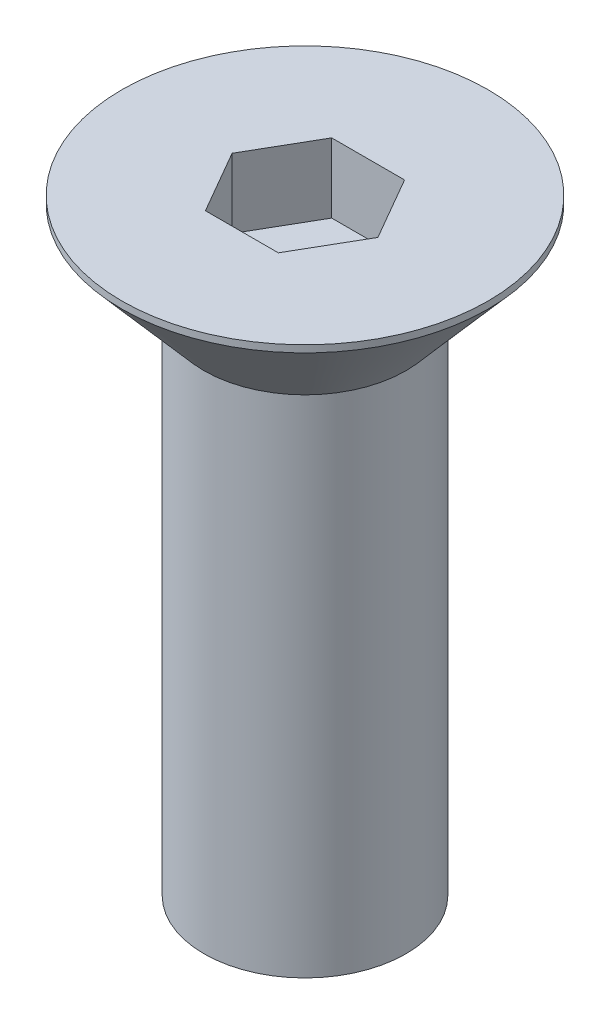
ISO-10303-21;
HEADER;
FILE_DESCRIPTION(('STEP AP214'),'2;1');
FILE_NAME('part.step','',(''),(''),'','','');
FILE_SCHEMA(('AUTOMOTIVE_DESIGN { 1 0 10303 214 1 1 1 1 }'));
ENDSEC;
DATA;
#1=APPLICATION_CONTEXT('core data for automotive mechanical design processes');
#2=APPLICATION_PROTOCOL_DEFINITION('international standard','automotive_design',2000,#1);
#3=PRODUCT_CONTEXT('',#1,'mechanical');
#4=PRODUCT('Part','Part','',(#3));
#5=PRODUCT_RELATED_PRODUCT_CATEGORY('part','',(#4));
#6=PRODUCT_DEFINITION_FORMATION('','',#4);
#7=PRODUCT_DEFINITION_CONTEXT('part definition',#1,'design');
#8=PRODUCT_DEFINITION('design','',#6,#7);
#9=PRODUCT_DEFINITION_SHAPE('','',#8);
#10=(LENGTH_UNIT() NAMED_UNIT(*) SI_UNIT(.MILLI.,.METRE.));
#11=(NAMED_UNIT(*) PLANE_ANGLE_UNIT() SI_UNIT($,.RADIAN.));
#12=(NAMED_UNIT(*) SI_UNIT($,.STERADIAN.) SOLID_ANGLE_UNIT());
#13=UNCERTAINTY_MEASURE_WITH_UNIT(LENGTH_MEASURE(1.E-05),#10,'distance_accuracy_value','');
#14=(GEOMETRIC_REPRESENTATION_CONTEXT(3) GLOBAL_UNCERTAINTY_ASSIGNED_CONTEXT((#13)) GLOBAL_UNIT_ASSIGNED_CONTEXT((#10,
#11,#12)) REPRESENTATION_CONTEXT('',''));
#15=CARTESIAN_POINT('',(0.,0.,0.));
#16=DIRECTION('',(0.,0.,1.));
#17=DIRECTION('',(1.,0.,0.));
#18=AXIS2_PLACEMENT_3D('',#15,#16,#17);
#19=CARTESIAN_POINT('',(0.,0.,0.));
#20=DIRECTION('',(0.,1.,0.));
#21=DIRECTION('',(0.,0.,1.));
#22=AXIS2_PLACEMENT_3D('',#19,#20,#21);
#23=CONICAL_SURFACE('',#22,6.35,0.715584993317676);
#24=CARTESIAN_POINT('',(0.,5.93518200100589,0.));
#25=DIRECTION('',(0.,-1.,0.));
#26=DIRECTION('',(0.,0.,-1.));
#27=AXIS2_PLACEMENT_3D('',#24,#25,#26);
#28=CIRCLE('',#27,11.509375);
#29=CARTESIAN_POINT('',(0.,5.93518200100589,-11.509375));
#30=VERTEX_POINT('',#29);
#31=EDGE_CURVE('E11',#30,#30,#28,.T.);
#32=ORIENTED_EDGE('',*,*,#31,.T.);
#33=EDGE_LOOP('',(#32));
#34=FACE_BOUND('',#33,.T.);
#35=CARTESIAN_POINT('',(0.,0.,0.));
#36=DIRECTION('',(0.,-1.,0.));
#37=DIRECTION('',(0.,0.,-1.));
#38=AXIS2_PLACEMENT_3D('',#35,#36,#37);
#39=CIRCLE('',#38,6.35);
#40=CARTESIAN_POINT('',(0.,0.,-6.35));
#41=VERTEX_POINT('',#40);
#42=EDGE_CURVE('E141',#41,#41,#39,.T.);
#43=ORIENTED_EDGE('',*,*,#42,.F.);
#44=EDGE_LOOP('',(#43));
#45=FACE_BOUND('',#44,.T.);
#46=ADVANCED_FACE('F30',(#34,#45),#23,.T.);
#47=CARTESIAN_POINT('',(0.,-1.82358766950444,0.));
#48=DIRECTION('',(0.,-1.,0.));
#49=DIRECTION('',(0.,0.,-1.));
#50=AXIS2_PLACEMENT_3D('',#47,#48,#49);
#51=CYLINDRICAL_SURFACE('',#50,11.509375);
#52=CARTESIAN_POINT('',(0.,6.3754,0.));
#53=DIRECTION('',(0.,-1.,0.));
#54=DIRECTION('',(0.,0.,-1.));
#55=AXIS2_PLACEMENT_3D('',#52,#53,#54);
#56=CIRCLE('',#55,11.509375);
#57=CARTESIAN_POINT('',(0.,6.3754,-11.509375));
#58=VERTEX_POINT('',#57);
#59=EDGE_CURVE('E37',#58,#58,#56,.T.);
#60=ORIENTED_EDGE('',*,*,#59,.T.);
#61=EDGE_LOOP('',(#60));
#62=FACE_BOUND('',#61,.T.);
#63=ORIENTED_EDGE('',*,*,#31,.F.);
#64=EDGE_LOOP('',(#63));
#65=FACE_BOUND('',#64,.T.);
#66=ADVANCED_FACE('F146',(#62,#65),#51,.T.);
#67=CARTESIAN_POINT('',(0.,6.3754,0.));
#68=DIRECTION('',(0.,1.,0.));
#69=DIRECTION('',(0.,0.,1.));
#70=AXIS2_PLACEMENT_3D('',#67,#68,#69);
#71=PLANE('',#70);
#72=DIRECTION('',(0.5,0.,0.866025403784438));
#73=VECTOR('',#72,1.);
#74=CARTESIAN_POINT('',(-4.58271776169266,6.3754,0.));
#75=LINE('',#74,#73);
#76=CARTESIAN_POINT('',(-4.58271776169266,6.3754,0.));
#77=VERTEX_POINT('',#76);
#78=CARTESIAN_POINT('',(-2.29135888084633,6.3754,3.96875));
#79=VERTEX_POINT('',#78);
#80=EDGE_CURVE('E44',#77,#79,#75,.T.);
#81=ORIENTED_EDGE('',*,*,#80,.F.);
#82=DIRECTION('',(-0.5,0.,0.866025403784439));
#83=VECTOR('',#82,1.);
#84=CARTESIAN_POINT('',(-2.29135888084633,6.3754,-3.96875));
#85=LINE('',#84,#83);
#86=CARTESIAN_POINT('',(-2.29135888084633,6.3754,-3.96875));
#87=VERTEX_POINT('',#86);
#88=EDGE_CURVE('E114',#87,#77,#85,.T.);
#89=ORIENTED_EDGE('',*,*,#88,.F.);
#90=DIRECTION('',(-1.,0.,0.));
#91=VECTOR('',#90,1.);
#92=CARTESIAN_POINT('',(2.29135888084632,6.3754,-3.96875));
#93=LINE('',#92,#91);
#94=CARTESIAN_POINT('',(2.29135888084632,6.3754,-3.96875));
#95=VERTEX_POINT('',#94);
#96=EDGE_CURVE('E108',#95,#87,#93,.T.);
#97=ORIENTED_EDGE('',*,*,#96,.F.);
#98=DIRECTION('',(-0.500000000000001,0.,-0.866025403784438));
#99=VECTOR('',#98,1.);
#100=CARTESIAN_POINT('',(4.58271776169266,6.3754,0.));
#101=LINE('',#100,#99);
#102=CARTESIAN_POINT('',(4.58271776169266,6.3754,0.));
#103=VERTEX_POINT('',#102);
#104=EDGE_CURVE('E106',#103,#95,#101,.T.);
#105=ORIENTED_EDGE('',*,*,#104,.F.);
#106=DIRECTION('',(0.5,0.,-0.866025403784439));
#107=VECTOR('',#106,1.);
#108=CARTESIAN_POINT('',(2.29135888084633,6.3754,3.96875));
#109=LINE('',#108,#107);
#110=CARTESIAN_POINT('',(2.29135888084633,6.3754,3.96875));
#111=VERTEX_POINT('',#110);
#112=EDGE_CURVE('E87',#111,#103,#109,.T.);
#113=ORIENTED_EDGE('',*,*,#112,.F.);
#114=DIRECTION('',(1.,0.,0.));
#115=VECTOR('',#114,1.);
#116=CARTESIAN_POINT('',(-2.29135888084633,6.3754,3.96875));
#117=LINE('',#116,#115);
#118=EDGE_CURVE('E98',#79,#111,#117,.T.);
#119=ORIENTED_EDGE('',*,*,#118,.F.);
#120=EDGE_LOOP('',(#81,#89,#97,#105,#113,#119));
#121=FACE_BOUND('',#120,.T.);
#122=ORIENTED_EDGE('',*,*,#59,.F.);
#123=EDGE_LOOP('',(#122));
#124=FACE_BOUND('',#123,.T.);
#125=ADVANCED_FACE('F102',(#121,#124),#71,.T.);
#126=CARTESIAN_POINT('',(0.,-31.75,0.));
#127=DIRECTION('',(0.,1.,0.));
#128=DIRECTION('',(0.,0.,1.));
#129=AXIS2_PLACEMENT_3D('',#126,#127,#128);
#130=CYLINDRICAL_SURFACE('',#129,6.35);
#131=CARTESIAN_POINT('',(0.,-31.75,0.));
#132=DIRECTION('',(0.,1.,0.));
#133=DIRECTION('',(0.,0.,1.));
#134=AXIS2_PLACEMENT_3D('',#131,#132,#133);
#135=CIRCLE('',#134,6.35);
#136=CARTESIAN_POINT('',(0.,-31.75,6.35));
#137=VERTEX_POINT('',#136);
#138=EDGE_CURVE('E132',#137,#137,#135,.T.);
#139=ORIENTED_EDGE('',*,*,#138,.T.);
#140=EDGE_LOOP('',(#139));
#141=FACE_BOUND('',#140,.T.);
#142=ORIENTED_EDGE('',*,*,#42,.T.);
#143=EDGE_LOOP('',(#142));
#144=FACE_BOUND('',#143,.T.);
#145=ADVANCED_FACE('F149',(#141,#144),#130,.T.);
#146=CARTESIAN_POINT('',(0.,-31.75,0.));
#147=DIRECTION('',(0.,1.,0.));
#148=DIRECTION('',(0.,0.,1.));
#149=AXIS2_PLACEMENT_3D('',#146,#147,#148);
#150=PLANE('',#149);
#151=ORIENTED_EDGE('',*,*,#138,.F.);
#152=EDGE_LOOP('',(#151));
#153=FACE_BOUND('',#152,.T.);
#154=ADVANCED_FACE('F155',(#153),#150,.F.);
#155=CARTESIAN_POINT('',(-4.58271776169266,2.0066,0.));
#156=DIRECTION('',(-0.866025403784438,0.,0.5));
#157=DIRECTION('',(0.5,0.,0.866025403784439));
#158=AXIS2_PLACEMENT_3D('',#155,#156,#157);
#159=PLANE('',#158);
#160=ORIENTED_EDGE('',*,*,#80,.T.);
#161=DIRECTION('',(0.,1.,0.));
#162=VECTOR('',#161,1.);
#163=CARTESIAN_POINT('',(-2.29135888084633,2.0066,3.96875));
#164=LINE('',#163,#162);
#165=CARTESIAN_POINT('',(-2.29135888084633,2.0066,3.96875));
#166=VERTEX_POINT('',#165);
#167=EDGE_CURVE('E95',#166,#79,#164,.T.);
#168=ORIENTED_EDGE('',*,*,#167,.F.);
#169=DIRECTION('',(0.5,0.,0.866025403784438));
#170=VECTOR('',#169,1.);
#171=CARTESIAN_POINT('',(-4.58271776169266,2.0066,0.));
#172=LINE('',#171,#170);
#173=CARTESIAN_POINT('',(-4.58271776169266,2.0066,0.));
#174=VERTEX_POINT('',#173);
#175=EDGE_CURVE('E116',#174,#166,#172,.T.);
#176=ORIENTED_EDGE('',*,*,#175,.F.);
#177=DIRECTION('',(0.,1.,0.));
#178=VECTOR('',#177,1.);
#179=CARTESIAN_POINT('',(-4.58271776169266,2.0066,0.));
#180=LINE('',#179,#178);
#181=EDGE_CURVE('E51',#174,#77,#180,.T.);
#182=ORIENTED_EDGE('',*,*,#181,.T.);
#183=EDGE_LOOP('',(#160,#168,#176,#182));
#184=FACE_BOUND('',#183,.T.);
#185=ADVANCED_FACE('F185',(#184),#159,.F.);
#186=CARTESIAN_POINT('',(-2.29135888084633,2.0066,-3.96875));
#187=DIRECTION('',(-0.866025403784439,0.,-0.5));
#188=DIRECTION('',(-0.5,0.,0.866025403784439));
#189=AXIS2_PLACEMENT_3D('',#186,#187,#188);
#190=PLANE('',#189);
#191=ORIENTED_EDGE('',*,*,#88,.T.);
#192=ORIENTED_EDGE('',*,*,#181,.F.);
#193=DIRECTION('',(-0.5,0.,0.866025403784439));
#194=VECTOR('',#193,1.);
#195=CARTESIAN_POINT('',(-2.29135888084633,2.0066,-3.96875));
#196=LINE('',#195,#194);
#197=CARTESIAN_POINT('',(-2.29135888084633,2.0066,-3.96875));
#198=VERTEX_POINT('',#197);
#199=EDGE_CURVE('E128',#198,#174,#196,.T.);
#200=ORIENTED_EDGE('',*,*,#199,.F.);
#201=DIRECTION('',(0.,1.,0.));
#202=VECTOR('',#201,1.);
#203=CARTESIAN_POINT('',(-2.29135888084633,2.0066,-3.96875));
#204=LINE('',#203,#202);
#205=EDGE_CURVE('E133',#198,#87,#204,.T.);
#206=ORIENTED_EDGE('',*,*,#205,.T.);
#207=EDGE_LOOP('',(#191,#192,#200,#206));
#208=FACE_BOUND('',#207,.T.);
#209=ADVANCED_FACE('F199',(#208),#190,.F.);
#210=CARTESIAN_POINT('',(2.29135888084632,2.0066,-3.96875));
#211=DIRECTION('',(0.,0.,-1.));
#212=DIRECTION('',(-1.,0.,0.));
#213=AXIS2_PLACEMENT_3D('',#210,#211,#212);
#214=PLANE('',#213);
#215=ORIENTED_EDGE('',*,*,#96,.T.);
#216=ORIENTED_EDGE('',*,*,#205,.F.);
#217=DIRECTION('',(-1.,0.,0.));
#218=VECTOR('',#217,1.);
#219=CARTESIAN_POINT('',(2.29135888084632,2.0066,-3.96875));
#220=LINE('',#219,#218);
#221=CARTESIAN_POINT('',(2.29135888084632,2.0066,-3.96875));
#222=VERTEX_POINT('',#221);
#223=EDGE_CURVE('E125',#222,#198,#220,.T.);
#224=ORIENTED_EDGE('',*,*,#223,.F.);
#225=DIRECTION('',(0.,1.,0.));
#226=VECTOR('',#225,1.);
#227=CARTESIAN_POINT('',(2.29135888084632,2.0066,-3.96875));
#228=LINE('',#227,#226);
#229=EDGE_CURVE('E135',#222,#95,#228,.T.);
#230=ORIENTED_EDGE('',*,*,#229,.T.);
#231=EDGE_LOOP('',(#215,#216,#224,#230));
#232=FACE_BOUND('',#231,.T.);
#233=ADVANCED_FACE('F208',(#232),#214,.F.);
#234=CARTESIAN_POINT('',(4.58271776169266,2.0066,0.));
#235=DIRECTION('',(0.866025403784438,0.,-0.500000000000001));
#236=DIRECTION('',(-0.500000000000001,0.,-0.866025403784438));
#237=AXIS2_PLACEMENT_3D('',#234,#235,#236);
#238=PLANE('',#237);
#239=ORIENTED_EDGE('',*,*,#104,.T.);
#240=ORIENTED_EDGE('',*,*,#229,.F.);
#241=DIRECTION('',(-0.500000000000001,0.,-0.866025403784438));
#242=VECTOR('',#241,1.);
#243=CARTESIAN_POINT('',(4.58271776169266,2.0066,0.));
#244=LINE('',#243,#242);
#245=CARTESIAN_POINT('',(4.58271776169266,2.0066,0.));
#246=VERTEX_POINT('',#245);
#247=EDGE_CURVE('E122',#246,#222,#244,.T.);
#248=ORIENTED_EDGE('',*,*,#247,.F.);
#249=DIRECTION('',(0.,1.,0.));
#250=VECTOR('',#249,1.);
#251=CARTESIAN_POINT('',(4.58271776169266,2.0066,0.));
#252=LINE('',#251,#250);
#253=EDGE_CURVE('E94',#246,#103,#252,.T.);
#254=ORIENTED_EDGE('',*,*,#253,.T.);
#255=EDGE_LOOP('',(#239,#240,#248,#254));
#256=FACE_BOUND('',#255,.T.);
#257=ADVANCED_FACE('F217',(#256),#238,.F.);
#258=CARTESIAN_POINT('',(2.29135888084633,2.0066,3.96875));
#259=DIRECTION('',(0.866025403784439,0.,0.5));
#260=DIRECTION('',(0.5,0.,-0.866025403784439));
#261=AXIS2_PLACEMENT_3D('',#258,#259,#260);
#262=PLANE('',#261);
#263=ORIENTED_EDGE('',*,*,#112,.T.);
#264=ORIENTED_EDGE('',*,*,#253,.F.);
#265=DIRECTION('',(0.5,0.,-0.866025403784439));
#266=VECTOR('',#265,1.);
#267=CARTESIAN_POINT('',(2.29135888084633,2.0066,3.96875));
#268=LINE('',#267,#266);
#269=CARTESIAN_POINT('',(2.29135888084633,2.0066,3.96875));
#270=VERTEX_POINT('',#269);
#271=EDGE_CURVE('E90',#270,#246,#268,.T.);
#272=ORIENTED_EDGE('',*,*,#271,.F.);
#273=DIRECTION('',(0.,1.,0.));
#274=VECTOR('',#273,1.);
#275=CARTESIAN_POINT('',(2.29135888084633,2.0066,3.96875));
#276=LINE('',#275,#274);
#277=EDGE_CURVE('E83',#270,#111,#276,.T.);
#278=ORIENTED_EDGE('',*,*,#277,.T.);
#279=EDGE_LOOP('',(#263,#264,#272,#278));
#280=FACE_BOUND('',#279,.T.);
#281=ADVANCED_FACE('F85',(#280),#262,.F.);
#282=CARTESIAN_POINT('',(-2.29135888084633,2.0066,3.96875));
#283=DIRECTION('',(0.,0.,1.));
#284=DIRECTION('',(1.,0.,0.));
#285=AXIS2_PLACEMENT_3D('',#282,#283,#284);
#286=PLANE('',#285);
#287=ORIENTED_EDGE('',*,*,#118,.T.);
#288=ORIENTED_EDGE('',*,*,#277,.F.);
#289=DIRECTION('',(1.,0.,0.));
#290=VECTOR('',#289,1.);
#291=CARTESIAN_POINT('',(-2.29135888084633,2.0066,3.96875));
#292=LINE('',#291,#290);
#293=EDGE_CURVE('E119',#166,#270,#292,.T.);
#294=ORIENTED_EDGE('',*,*,#293,.F.);
#295=ORIENTED_EDGE('',*,*,#167,.T.);
#296=EDGE_LOOP('',(#287,#288,#294,#295));
#297=FACE_BOUND('',#296,.T.);
#298=ADVANCED_FACE('F99',(#297),#286,.F.);
#299=CARTESIAN_POINT('',(-4.58271776169266,2.0066,0.));
#300=DIRECTION('',(0.,-1.,0.));
#301=DIRECTION('',(0.,0.,-1.));
#302=AXIS2_PLACEMENT_3D('',#299,#300,#301);
#303=PLANE('',#302);
#304=ORIENTED_EDGE('',*,*,#175,.T.);
#305=ORIENTED_EDGE('',*,*,#293,.T.);
#306=ORIENTED_EDGE('',*,*,#271,.T.);
#307=ORIENTED_EDGE('',*,*,#247,.T.);
#308=ORIENTED_EDGE('',*,*,#223,.T.);
#309=ORIENTED_EDGE('',*,*,#199,.T.);
#310=EDGE_LOOP('',(#304,#305,#306,#307,#308,#309));
#311=FACE_BOUND('',#310,.T.);
#312=ADVANCED_FACE('F244',(#311),#303,.F.);
#313=CLOSED_SHELL('',(#46,#66,#125,#145,#154,#185,#209,#233,#257,#281,#298,#312));
#314=MANIFOLD_SOLID_BREP('B2',#313);
#315=ADVANCED_BREP_SHAPE_REPRESENTATION('',(#18,#314),#14);
#316=SHAPE_DEFINITION_REPRESENTATION(#9,#315);
ENDSEC;
END-ISO-10303-21;
